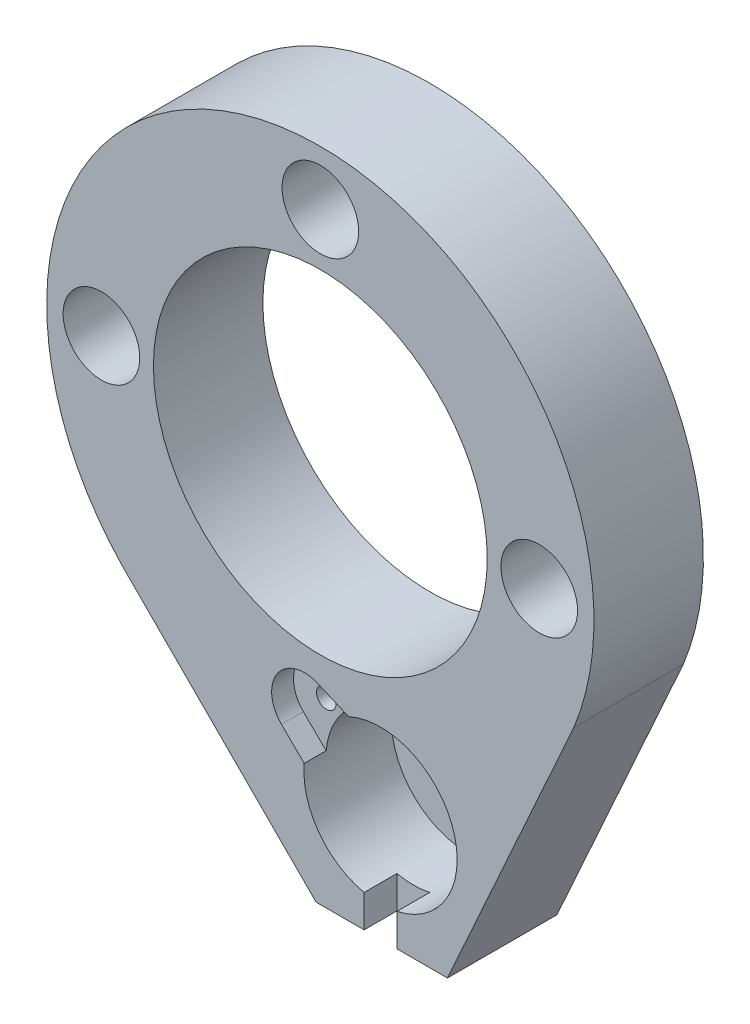
ISO-10303-21;
HEADER;
FILE_DESCRIPTION(('STEP AP214'),'2;1');
FILE_NAME('part.step','',(''),(''),'','','');
FILE_SCHEMA(('AUTOMOTIVE_DESIGN { 1 0 10303 214 1 1 1 1 }'));
ENDSEC;
DATA;
#1=APPLICATION_CONTEXT('core data for automotive mechanical design processes');
#2=APPLICATION_PROTOCOL_DEFINITION('international standard','automotive_design',2000,#1);
#3=PRODUCT_CONTEXT('',#1,'mechanical');
#4=PRODUCT('Part','Part','',(#3));
#5=PRODUCT_RELATED_PRODUCT_CATEGORY('part','',(#4));
#6=PRODUCT_DEFINITION_FORMATION('','',#4);
#7=PRODUCT_DEFINITION_CONTEXT('part definition',#1,'design');
#8=PRODUCT_DEFINITION('design','',#6,#7);
#9=PRODUCT_DEFINITION_SHAPE('','',#8);
#10=(LENGTH_UNIT() NAMED_UNIT(*) SI_UNIT(.MILLI.,.METRE.));
#11=(NAMED_UNIT(*) PLANE_ANGLE_UNIT() SI_UNIT($,.RADIAN.));
#12=(NAMED_UNIT(*) SI_UNIT($,.STERADIAN.) SOLID_ANGLE_UNIT());
#13=UNCERTAINTY_MEASURE_WITH_UNIT(LENGTH_MEASURE(1.E-05),#10,'distance_accuracy_value','');
#14=(GEOMETRIC_REPRESENTATION_CONTEXT(3) GLOBAL_UNCERTAINTY_ASSIGNED_CONTEXT((#13)) GLOBAL_UNIT_ASSIGNED_CONTEXT((#10,
#11,#12)) REPRESENTATION_CONTEXT('',''));
#15=CARTESIAN_POINT('',(0.,0.,0.));
#16=DIRECTION('',(0.,0.,1.));
#17=DIRECTION('',(1.,0.,0.));
#18=AXIS2_PLACEMENT_3D('',#15,#16,#17);
#19=CARTESIAN_POINT('',(20.,0.,10.));
#20=DIRECTION('',(0.,0.,-1.));
#21=DIRECTION('',(-1.,0.,0.));
#22=AXIS2_PLACEMENT_3D('',#19,#20,#21);
#23=CYLINDRICAL_SURFACE('',#22,1.5);
#24=CARTESIAN_POINT('',(20.,0.,0.));
#25=DIRECTION('',(0.,0.,1.));
#26=DIRECTION('',(1.,0.,0.));
#27=AXIS2_PLACEMENT_3D('',#24,#25,#26);
#28=CIRCLE('',#27,1.5);
#29=CARTESIAN_POINT('',(21.5,0.,0.));
#30=VERTEX_POINT('',#29);
#31=EDGE_CURVE('E293',#30,#30,#28,.T.);
#32=ORIENTED_EDGE('',*,*,#31,.F.);
#33=EDGE_LOOP('',(#32));
#34=FACE_BOUND('',#33,.T.);
#35=CARTESIAN_POINT('',(20.,0.,5.));
#36=DIRECTION('',(0.,0.,1.));
#37=DIRECTION('',(1.,0.,0.));
#38=AXIS2_PLACEMENT_3D('',#35,#36,#37);
#39=CIRCLE('',#38,1.5);
#40=CARTESIAN_POINT('',(21.5,0.,5.));
#41=VERTEX_POINT('',#40);
#42=EDGE_CURVE('E34',#41,#41,#39,.T.);
#43=ORIENTED_EDGE('',*,*,#42,.T.);
#44=EDGE_LOOP('',(#43));
#45=FACE_BOUND('',#44,.T.);
#46=ADVANCED_FACE('F30',(#34,#45),#23,.F.);
#47=CARTESIAN_POINT('',(0.,20.,10.));
#48=DIRECTION('',(0.,0.,-1.));
#49=DIRECTION('',(-1.,0.,0.));
#50=AXIS2_PLACEMENT_3D('',#47,#48,#49);
#51=CYLINDRICAL_SURFACE('',#50,1.5);
#52=CARTESIAN_POINT('',(0.,20.,0.));
#53=DIRECTION('',(0.,0.,1.));
#54=DIRECTION('',(1.,0.,0.));
#55=AXIS2_PLACEMENT_3D('',#52,#53,#54);
#56=CIRCLE('',#55,1.5);
#57=CARTESIAN_POINT('',(1.5,20.,0.));
#58=VERTEX_POINT('',#57);
#59=EDGE_CURVE('E169',#58,#58,#56,.T.);
#60=ORIENTED_EDGE('',*,*,#59,.F.);
#61=EDGE_LOOP('',(#60));
#62=FACE_BOUND('',#61,.T.);
#63=CARTESIAN_POINT('',(0.,20.,5.));
#64=DIRECTION('',(0.,0.,1.));
#65=DIRECTION('',(1.,0.,0.));
#66=AXIS2_PLACEMENT_3D('',#63,#64,#65);
#67=CIRCLE('',#66,1.5);
#68=CARTESIAN_POINT('',(1.5,20.,5.));
#69=VERTEX_POINT('',#68);
#70=EDGE_CURVE('E295',#69,#69,#67,.T.);
#71=ORIENTED_EDGE('',*,*,#70,.T.);
#72=EDGE_LOOP('',(#71));
#73=FACE_BOUND('',#72,.T.);
#74=ADVANCED_FACE('F327',(#62,#73),#51,.F.);
#75=CARTESIAN_POINT('',(-20.,0.,10.));
#76=DIRECTION('',(0.,0.,-1.));
#77=DIRECTION('',(-1.,0.,0.));
#78=AXIS2_PLACEMENT_3D('',#75,#76,#77);
#79=CYLINDRICAL_SURFACE('',#78,1.5);
#80=CARTESIAN_POINT('',(-20.,0.,0.));
#81=DIRECTION('',(0.,0.,1.));
#82=DIRECTION('',(1.,0.,0.));
#83=AXIS2_PLACEMENT_3D('',#80,#81,#82);
#84=CIRCLE('',#83,1.5);
#85=CARTESIAN_POINT('',(-18.5,0.,0.));
#86=VERTEX_POINT('',#85);
#87=EDGE_CURVE('E317',#86,#86,#84,.T.);
#88=ORIENTED_EDGE('',*,*,#87,.F.);
#89=EDGE_LOOP('',(#88));
#90=FACE_BOUND('',#89,.T.);
#91=CARTESIAN_POINT('',(-20.,0.,5.));
#92=DIRECTION('',(0.,0.,1.));
#93=DIRECTION('',(1.,0.,0.));
#94=AXIS2_PLACEMENT_3D('',#91,#92,#93);
#95=CIRCLE('',#94,1.5);
#96=CARTESIAN_POINT('',(-18.5,0.,5.));
#97=VERTEX_POINT('',#96);
#98=EDGE_CURVE('E291',#97,#97,#95,.T.);
#99=ORIENTED_EDGE('',*,*,#98,.T.);
#100=EDGE_LOOP('',(#99));
#101=FACE_BOUND('',#100,.T.);
#102=ADVANCED_FACE('F329',(#90,#101),#79,.F.);
#103=CARTESIAN_POINT('',(0.,0.,10.));
#104=DIRECTION('',(0.,0.,1.));
#105=DIRECTION('',(1.,0.,0.));
#106=AXIS2_PLACEMENT_3D('',#103,#104,#105);
#107=PLANE('',#106);
#108=CARTESIAN_POINT('',(20.,0.,10.));
#109=DIRECTION('',(0.,0.,1.));
#110=DIRECTION('',(1.,0.,0.));
#111=AXIS2_PLACEMENT_3D('',#108,#109,#110);
#112=CIRCLE('',#111,3.5);
#113=CARTESIAN_POINT('',(23.5,0.,10.));
#114=VERTEX_POINT('',#113);
#115=EDGE_CURVE('E311',#114,#114,#112,.T.);
#116=ORIENTED_EDGE('',*,*,#115,.F.);
#117=EDGE_LOOP('',(#116));
#118=FACE_BOUND('',#117,.T.);
#119=CARTESIAN_POINT('',(0.,20.,10.));
#120=DIRECTION('',(0.,0.,1.));
#121=DIRECTION('',(1.,0.,0.));
#122=AXIS2_PLACEMENT_3D('',#119,#120,#121);
#123=CIRCLE('',#122,3.5);
#124=CARTESIAN_POINT('',(3.5,20.,10.));
#125=VERTEX_POINT('',#124);
#126=EDGE_CURVE('E304',#125,#125,#123,.T.);
#127=ORIENTED_EDGE('',*,*,#126,.F.);
#128=EDGE_LOOP('',(#127));
#129=FACE_BOUND('',#128,.T.);
#130=CARTESIAN_POINT('',(-20.,0.,10.));
#131=DIRECTION('',(0.,0.,1.));
#132=DIRECTION('',(1.,0.,0.));
#133=AXIS2_PLACEMENT_3D('',#130,#131,#132);
#134=CIRCLE('',#133,3.5);
#135=CARTESIAN_POINT('',(-16.5,0.,10.));
#136=VERTEX_POINT('',#135);
#137=EDGE_CURVE('E297',#136,#136,#134,.T.);
#138=ORIENTED_EDGE('',*,*,#137,.F.);
#139=EDGE_LOOP('',(#138));
#140=FACE_BOUND('',#139,.T.);
#141=CARTESIAN_POINT('',(0.,0.,10.));
#142=DIRECTION('',(0.,0.,1.));
#143=DIRECTION('',(1.,0.,0.));
#144=AXIS2_PLACEMENT_3D('',#141,#142,#143);
#145=CIRCLE('',#144,15.25);
#146=CARTESIAN_POINT('',(15.25,0.,10.));
#147=VERTEX_POINT('',#146);
#148=EDGE_CURVE('E251',#147,#147,#145,.T.);
#149=ORIENTED_EDGE('',*,*,#148,.F.);
#150=EDGE_LOOP('',(#149));
#151=FACE_BOUND('',#150,.T.);
#152=DIRECTION('',(-0.919751155742739,0.392501989179541,0.));
#153=VECTOR('',#152,1.);
#154=CARTESIAN_POINT('',(-0.272375102761685,-17.6115350120765,10.));
#155=LINE('',#154,#153);
#156=CARTESIAN_POINT('',(2.59054903818514,-18.8332822348721,10.));
#157=VERTEX_POINT('',#156);
#158=CARTESIAN_POINT('',(-0.272375102761685,-17.6115350120765,10.));
#159=VERTEX_POINT('',#158);
#160=EDGE_CURVE('E163',#157,#159,#155,.T.);
#161=ORIENTED_EDGE('',*,*,#160,.F.);
#162=CARTESIAN_POINT('',(5.5,-25.2,10.));
#163=DIRECTION('',(0.,0.,1.));
#164=DIRECTION('',(1.,0.,0.));
#165=AXIS2_PLACEMENT_3D('',#162,#163,#164);
#166=CIRCLE('',#165,7.);
#167=CARTESIAN_POINT('',(7.,-32.0373971655887,10.));
#168=VERTEX_POINT('',#167);
#169=EDGE_CURVE('E244',#168,#157,#166,.T.);
#170=ORIENTED_EDGE('',*,*,#169,.F.);
#171=DIRECTION('',(0.,1.,0.));
#172=VECTOR('',#171,1.);
#173=CARTESIAN_POINT('',(7.,-35.,10.));
#174=LINE('',#173,#172);
#175=CARTESIAN_POINT('',(7.,-35.,10.));
#176=VERTEX_POINT('',#175);
#177=EDGE_CURVE('E221',#176,#168,#174,.T.);
#178=ORIENTED_EDGE('',*,*,#177,.F.);
#179=DIRECTION('',(1.,0.,0.));
#180=VECTOR('',#179,1.);
#181=CARTESIAN_POINT('',(-0.385076954837017,-35.,10.));
#182=LINE('',#181,#180);
#183=CARTESIAN_POINT('',(11.614923045163,-35.,10.));
#184=VERTEX_POINT('',#183);
#185=EDGE_CURVE('E258',#176,#184,#182,.T.);
#186=ORIENTED_EDGE('',*,*,#185,.T.);
#187=DIRECTION('',(0.411264502619458,0.911516049713426,0.));
#188=VECTOR('',#187,1.);
#189=CARTESIAN_POINT('',(11.614923045163,-35.,10.));
#190=LINE('',#189,#188);
#191=CARTESIAN_POINT('',(23.1670303134359,-9.3962070249831,10.));
#192=VERTEX_POINT('',#191);
#193=EDGE_CURVE('E263',#184,#192,#190,.T.);
#194=ORIENTED_EDGE('',*,*,#193,.T.);
#195=CARTESIAN_POINT('',(0.,0.,10.));
#196=DIRECTION('',(0.,0.,1.));
#197=DIRECTION('',(1.,0.,0.));
#198=AXIS2_PLACEMENT_3D('',#195,#196,#197);
#199=CIRCLE('',#198,25.);
#200=CARTESIAN_POINT('',(-18.121718507486,-17.2221751917532,10.));
#201=VERTEX_POINT('',#200);
#202=EDGE_CURVE('E265',#192,#201,#199,.T.);
#203=ORIENTED_EDGE('',*,*,#202,.T.);
#204=DIRECTION('',(0.706286331738627,-0.707926279777206,0.));
#205=VECTOR('',#204,1.);
#206=CARTESIAN_POINT('',(-18.121718507486,-17.2221751917532,10.));
#207=LINE('',#206,#205);
#208=CARTESIAN_POINT('',(-0.385076954837017,-35.,10.));
#209=VERTEX_POINT('',#208);
#210=EDGE_CURVE('E255',#201,#209,#207,.T.);
#211=ORIENTED_EDGE('',*,*,#210,.T.);
#212=CARTESIAN_POINT('',(4.,-35.,10.));
#213=VERTEX_POINT('',#212);
#214=EDGE_CURVE('E260',#209,#213,#182,.T.);
#215=ORIENTED_EDGE('',*,*,#214,.T.);
#216=DIRECTION('',(0.,-1.,0.));
#217=VECTOR('',#216,1.);
#218=CARTESIAN_POINT('',(4.,-35.,10.));
#219=LINE('',#218,#217);
#220=CARTESIAN_POINT('',(4.,-32.0373971655887,10.));
#221=VERTEX_POINT('',#220);
#222=EDGE_CURVE('E210',#221,#213,#219,.T.);
#223=ORIENTED_EDGE('',*,*,#222,.F.);
#224=CARTESIAN_POINT('',(-1.47056063690864,-24.5586854070115,10.));
#225=VERTEX_POINT('',#224);
#226=EDGE_CURVE('E232',#225,#221,#166,.T.);
#227=ORIENTED_EDGE('',*,*,#226,.F.);
#228=DIRECTION('',(0.712887138889984,-0.701278779947927,0.));
#229=VECTOR('',#228,1.);
#230=CARTESIAN_POINT('',(-3.55371741014409,-22.5094498959747,10.));
#231=LINE('',#230,#229);
#232=CARTESIAN_POINT('',(-3.55371741014409,-22.5094498959747,10.));
#233=VERTEX_POINT('',#232);
#234=EDGE_CURVE('E166',#233,#225,#231,.T.);
#235=ORIENTED_EDGE('',*,*,#234,.F.);
#236=CARTESIAN_POINT('',(-1.44988107030031,-20.3707884793047,10.));
#237=DIRECTION('',(0.,0.,1.));
#238=DIRECTION('',(1.,0.,0.));
#239=AXIS2_PLACEMENT_3D('',#236,#237,#238);
#240=CIRCLE('',#239,3.);
#241=EDGE_CURVE('E151',#159,#233,#240,.T.);
#242=ORIENTED_EDGE('',*,*,#241,.F.);
#243=EDGE_LOOP('',(#161,#170,#178,#186,#194,#203,#211,#215,#223,#227,#235,#242));
#244=FACE_BOUND('',#243,.T.);
#245=ADVANCED_FACE('F335',(#118,#129,#140,#151,#244),#107,.T.);
#246=CARTESIAN_POINT('',(0.,0.,0.));
#247=DIRECTION('',(0.,0.,1.));
#248=DIRECTION('',(1.,0.,0.));
#249=AXIS2_PLACEMENT_3D('',#246,#247,#248);
#250=PLANE('',#249);
#251=ORIENTED_EDGE('',*,*,#87,.T.);
#252=EDGE_LOOP('',(#251));
#253=FACE_BOUND('',#252,.T.);
#254=DIRECTION('',(0.706286331738627,-0.707926279777206,0.));
#255=VECTOR('',#254,1.);
#256=CARTESIAN_POINT('',(-18.121718507486,-17.2221751917532,0.));
#257=LINE('',#256,#255);
#258=CARTESIAN_POINT('',(-18.121718507486,-17.2221751917532,0.));
#259=VERTEX_POINT('',#258);
#260=CARTESIAN_POINT('',(-0.385076954837017,-35.,0.));
#261=VERTEX_POINT('',#260);
#262=EDGE_CURVE('E250',#259,#261,#257,.T.);
#263=ORIENTED_EDGE('',*,*,#262,.F.);
#264=CARTESIAN_POINT('',(0.,0.,0.));
#265=DIRECTION('',(0.,0.,1.));
#266=DIRECTION('',(1.,0.,0.));
#267=AXIS2_PLACEMENT_3D('',#264,#265,#266);
#268=CIRCLE('',#267,25.);
#269=CARTESIAN_POINT('',(23.1670303134359,-9.3962070249831,0.));
#270=VERTEX_POINT('',#269);
#271=EDGE_CURVE('E259',#270,#259,#268,.T.);
#272=ORIENTED_EDGE('',*,*,#271,.F.);
#273=DIRECTION('',(0.411264502619458,0.911516049713426,0.));
#274=VECTOR('',#273,1.);
#275=CARTESIAN_POINT('',(11.614923045163,-35.,0.));
#276=LINE('',#275,#274);
#277=CARTESIAN_POINT('',(11.614923045163,-35.,0.));
#278=VERTEX_POINT('',#277);
#279=EDGE_CURVE('E272',#278,#270,#276,.T.);
#280=ORIENTED_EDGE('',*,*,#279,.F.);
#281=DIRECTION('',(1.,0.,0.));
#282=VECTOR('',#281,1.);
#283=CARTESIAN_POINT('',(-0.385076954837017,-35.,0.));
#284=LINE('',#283,#282);
#285=EDGE_CURVE('E270',#261,#278,#284,.T.);
#286=ORIENTED_EDGE('',*,*,#285,.F.);
#287=EDGE_LOOP('',(#263,#272,#280,#286));
#288=FACE_BOUND('',#287,.T.);
#289=CARTESIAN_POINT('',(0.,0.,0.));
#290=DIRECTION('',(0.,0.,1.));
#291=DIRECTION('',(1.,0.,0.));
#292=AXIS2_PLACEMENT_3D('',#289,#290,#291);
#293=CIRCLE('',#292,15.25);
#294=CARTESIAN_POINT('',(15.25,0.,0.));
#295=VERTEX_POINT('',#294);
#296=EDGE_CURVE('E247',#295,#295,#293,.T.);
#297=ORIENTED_EDGE('',*,*,#296,.T.);
#298=EDGE_LOOP('',(#297));
#299=FACE_BOUND('',#298,.T.);
#300=CARTESIAN_POINT('',(5.5,-25.2,0.));
#301=DIRECTION('',(0.,0.,1.));
#302=DIRECTION('',(1.,0.,0.));
#303=AXIS2_PLACEMENT_3D('',#300,#301,#302);
#304=CIRCLE('',#303,2.65);
#305=CARTESIAN_POINT('',(8.15,-25.2,0.));
#306=VERTEX_POINT('',#305);
#307=EDGE_CURVE('E254',#306,#306,#304,.T.);
#308=ORIENTED_EDGE('',*,*,#307,.T.);
#309=EDGE_LOOP('',(#308));
#310=FACE_BOUND('',#309,.T.);
#311=DIRECTION('',(1.,0.,0.));
#312=VECTOR('',#311,1.);
#313=CARTESIAN_POINT('',(0.5,-25.7910088137421,0.));
#314=LINE('',#313,#312);
#315=CARTESIAN_POINT('',(-0.5,-25.7910088137421,0.));
#316=VERTEX_POINT('',#315);
#317=CARTESIAN_POINT('',(0.5,-25.7910088137421,0.));
#318=VERTEX_POINT('',#317);
#319=EDGE_CURVE('E195',#316,#318,#314,.T.);
#320=ORIENTED_EDGE('',*,*,#319,.T.);
#321=DIRECTION('',(0.,1.,0.));
#322=VECTOR('',#321,1.);
#323=CARTESIAN_POINT('',(0.499999999999999,-23.6910088137421,0.));
#324=LINE('',#323,#322);
#325=CARTESIAN_POINT('',(0.499999999999999,-23.6910088137421,0.));
#326=VERTEX_POINT('',#325);
#327=EDGE_CURVE('E187',#318,#326,#324,.T.);
#328=ORIENTED_EDGE('',*,*,#327,.T.);
#329=DIRECTION('',(-1.,0.,0.));
#330=VECTOR('',#329,1.);
#331=CARTESIAN_POINT('',(0.499999999999999,-23.6910088137421,0.));
#332=LINE('',#331,#330);
#333=CARTESIAN_POINT('',(-0.500000000000001,-23.6910088137421,0.));
#334=VERTEX_POINT('',#333);
#335=EDGE_CURVE('E190',#326,#334,#332,.T.);
#336=ORIENTED_EDGE('',*,*,#335,.T.);
#337=DIRECTION('',(0.,-1.,0.));
#338=VECTOR('',#337,1.);
#339=CARTESIAN_POINT('',(-0.500000000000001,-23.6910088137421,0.));
#340=LINE('',#339,#338);
#341=EDGE_CURVE('E55',#334,#316,#340,.T.);
#342=ORIENTED_EDGE('',*,*,#341,.T.);
#343=EDGE_LOOP('',(#320,#328,#336,#342));
#344=FACE_BOUND('',#343,.T.);
#345=ORIENTED_EDGE('',*,*,#59,.T.);
#346=EDGE_LOOP('',(#345));
#347=FACE_BOUND('',#346,.T.);
#348=ORIENTED_EDGE('',*,*,#31,.T.);
#349=EDGE_LOOP('',(#348));
#350=FACE_BOUND('',#349,.T.);
#351=ADVANCED_FACE('F324',(#253,#288,#299,#310,#344,#347,#350),#250,.F.);
#352=CARTESIAN_POINT('',(5.5,-25.2,10.));
#353=DIRECTION('',(0.,0.,1.));
#354=DIRECTION('',(1.,0.,0.));
#355=AXIS2_PLACEMENT_3D('',#352,#353,#354);
#356=CYLINDRICAL_SURFACE('',#355,2.65);
#357=ORIENTED_EDGE('',*,*,#307,.F.);
#358=EDGE_LOOP('',(#357));
#359=FACE_BOUND('',#358,.T.);
#360=CARTESIAN_POINT('',(5.5,-25.2,2.));
#361=DIRECTION('',(0.,0.,1.));
#362=DIRECTION('',(1.,0.,0.));
#363=AXIS2_PLACEMENT_3D('',#360,#361,#362);
#364=CIRCLE('',#363,2.65);
#365=CARTESIAN_POINT('',(8.15,-25.2,2.));
#366=VERTEX_POINT('',#365);
#367=EDGE_CURVE('E243',#366,#366,#364,.F.);
#368=ORIENTED_EDGE('',*,*,#367,.F.);
#369=EDGE_LOOP('',(#368));
#370=FACE_BOUND('',#369,.T.);
#371=ADVANCED_FACE('F397',(#359,#370),#356,.F.);
#372=CARTESIAN_POINT('',(-18.121718507486,-17.2221751917532,10.));
#373=DIRECTION('',(0.707926279777206,0.706286331738627,0.));
#374=DIRECTION('',(-0.706286331738627,0.707926279777206,0.));
#375=AXIS2_PLACEMENT_3D('',#372,#373,#374);
#376=PLANE('',#375);
#377=ORIENTED_EDGE('',*,*,#262,.T.);
#378=DIRECTION('',(0.,0.,-1.));
#379=VECTOR('',#378,1.);
#380=CARTESIAN_POINT('',(-0.385076954837017,-35.,10.));
#381=LINE('',#380,#379);
#382=EDGE_CURVE('E39',#209,#261,#381,.T.);
#383=ORIENTED_EDGE('',*,*,#382,.F.);
#384=ORIENTED_EDGE('',*,*,#210,.F.);
#385=DIRECTION('',(0.,0.,-1.));
#386=VECTOR('',#385,1.);
#387=CARTESIAN_POINT('',(-18.121718507486,-17.2221751917532,10.));
#388=LINE('',#387,#386);
#389=EDGE_CURVE('E267',#201,#259,#388,.T.);
#390=ORIENTED_EDGE('',*,*,#389,.T.);
#391=EDGE_LOOP('',(#377,#383,#384,#390));
#392=FACE_BOUND('',#391,.T.);
#393=ADVANCED_FACE('F32',(#392),#376,.F.);
#394=CARTESIAN_POINT('',(-0.385076954837017,-35.,10.));
#395=DIRECTION('',(0.,1.,0.));
#396=DIRECTION('',(0.,0.,1.));
#397=AXIS2_PLACEMENT_3D('',#394,#395,#396);
#398=PLANE('',#397);
#399=DIRECTION('',(1.,0.,0.));
#400=VECTOR('',#399,1.);
#401=CARTESIAN_POINT('',(4.,-35.,7.));
#402=LINE('',#401,#400);
#403=CARTESIAN_POINT('',(4.,-35.,7.));
#404=VERTEX_POINT('',#403);
#405=CARTESIAN_POINT('',(7.,-35.,7.));
#406=VERTEX_POINT('',#405);
#407=EDGE_CURVE('E220',#404,#406,#402,.T.);
#408=ORIENTED_EDGE('',*,*,#407,.F.);
#409=DIRECTION('',(0.,0.,1.));
#410=VECTOR('',#409,1.);
#411=CARTESIAN_POINT('',(4.,-35.,7.));
#412=LINE('',#411,#410);
#413=EDGE_CURVE('E226',#404,#213,#412,.T.);
#414=ORIENTED_EDGE('',*,*,#413,.T.);
#415=ORIENTED_EDGE('',*,*,#214,.F.);
#416=ORIENTED_EDGE('',*,*,#382,.T.);
#417=ORIENTED_EDGE('',*,*,#285,.T.);
#418=DIRECTION('',(0.,0.,-1.));
#419=VECTOR('',#418,1.);
#420=CARTESIAN_POINT('',(11.614923045163,-35.,10.));
#421=LINE('',#420,#419);
#422=EDGE_CURVE('E280',#184,#278,#421,.T.);
#423=ORIENTED_EDGE('',*,*,#422,.F.);
#424=ORIENTED_EDGE('',*,*,#185,.F.);
#425=DIRECTION('',(0.,0.,1.));
#426=VECTOR('',#425,1.);
#427=CARTESIAN_POINT('',(7.,-35.,7.));
#428=LINE('',#427,#426);
#429=EDGE_CURVE('E236',#406,#176,#428,.T.);
#430=ORIENTED_EDGE('',*,*,#429,.F.);
#431=EDGE_LOOP('',(#408,#414,#415,#416,#417,#423,#424,#430));
#432=FACE_BOUND('',#431,.T.);
#433=ADVANCED_FACE('F415',(#432),#398,.F.);
#434=CARTESIAN_POINT('',(11.614923045163,-35.,10.));
#435=DIRECTION('',(-0.911516049713426,0.411264502619458,0.));
#436=DIRECTION('',(-0.411264502619458,-0.911516049713427,0.));
#437=AXIS2_PLACEMENT_3D('',#434,#435,#436);
#438=PLANE('',#437);
#439=ORIENTED_EDGE('',*,*,#279,.T.);
#440=DIRECTION('',(0.,0.,-1.));
#441=VECTOR('',#440,1.);
#442=CARTESIAN_POINT('',(23.1670303134359,-9.3962070249831,10.));
#443=LINE('',#442,#441);
#444=EDGE_CURVE('E277',#192,#270,#443,.T.);
#445=ORIENTED_EDGE('',*,*,#444,.F.);
#446=ORIENTED_EDGE('',*,*,#193,.F.);
#447=ORIENTED_EDGE('',*,*,#422,.T.);
#448=EDGE_LOOP('',(#439,#445,#446,#447));
#449=FACE_BOUND('',#448,.T.);
#450=ADVANCED_FACE('F412',(#449),#438,.F.);
#451=CARTESIAN_POINT('',(0.,0.,10.));
#452=DIRECTION('',(0.,0.,-1.));
#453=DIRECTION('',(-1.,0.,0.));
#454=AXIS2_PLACEMENT_3D('',#451,#452,#453);
#455=CYLINDRICAL_SURFACE('',#454,25.);
#456=ORIENTED_EDGE('',*,*,#271,.T.);
#457=ORIENTED_EDGE('',*,*,#389,.F.);
#458=ORIENTED_EDGE('',*,*,#202,.F.);
#459=ORIENTED_EDGE('',*,*,#444,.T.);
#460=EDGE_LOOP('',(#456,#457,#458,#459));
#461=FACE_BOUND('',#460,.T.);
#462=ADVANCED_FACE('F403',(#461),#455,.T.);
#463=CARTESIAN_POINT('',(0.,0.,0.));
#464=DIRECTION('',(0.,0.,1.));
#465=DIRECTION('',(1.,0.,0.));
#466=AXIS2_PLACEMENT_3D('',#463,#464,#465);
#467=CYLINDRICAL_SURFACE('',#466,15.25);
#468=ORIENTED_EDGE('',*,*,#296,.F.);
#469=EDGE_LOOP('',(#468));
#470=FACE_BOUND('',#469,.T.);
#471=ORIENTED_EDGE('',*,*,#148,.T.);
#472=EDGE_LOOP('',(#471));
#473=FACE_BOUND('',#472,.T.);
#474=ADVANCED_FACE('F392',(#470,#473),#467,.F.);
#475=CARTESIAN_POINT('',(5.5,-25.2,2.));
#476=DIRECTION('',(0.,0.,1.));
#477=DIRECTION('',(1.,0.,0.));
#478=AXIS2_PLACEMENT_3D('',#475,#476,#477);
#479=PLANE('',#478);
#480=DIRECTION('',(0.,1.,0.));
#481=VECTOR('',#480,1.);
#482=CARTESIAN_POINT('',(0.499999999999999,-23.6910088137421,2.));
#483=LINE('',#482,#481);
#484=CARTESIAN_POINT('',(0.5,-25.7910088137421,2.));
#485=VERTEX_POINT('',#484);
#486=CARTESIAN_POINT('',(0.5,-23.6910088137421,2.));
#487=VERTEX_POINT('',#486);
#488=EDGE_CURVE('E186',#485,#487,#483,.T.);
#489=ORIENTED_EDGE('',*,*,#488,.F.);
#490=DIRECTION('',(1.,0.,0.));
#491=VECTOR('',#490,1.);
#492=CARTESIAN_POINT('',(0.5,-25.7910088137421,2.));
#493=LINE('',#492,#491);
#494=CARTESIAN_POINT('',(-0.5,-25.7910088137421,2.));
#495=VERTEX_POINT('',#494);
#496=EDGE_CURVE('E191',#495,#485,#493,.T.);
#497=ORIENTED_EDGE('',*,*,#496,.F.);
#498=DIRECTION('',(0.,-1.,0.));
#499=VECTOR('',#498,1.);
#500=CARTESIAN_POINT('',(-0.500000000000001,-23.6910088137421,2.));
#501=LINE('',#500,#499);
#502=CARTESIAN_POINT('',(-0.500000000000001,-23.6910088137421,2.));
#503=VERTEX_POINT('',#502);
#504=EDGE_CURVE('E203',#503,#495,#501,.T.);
#505=ORIENTED_EDGE('',*,*,#504,.F.);
#506=DIRECTION('',(-1.,0.,0.));
#507=VECTOR('',#506,1.);
#508=CARTESIAN_POINT('',(0.499999999999999,-23.6910088137421,2.));
#509=LINE('',#508,#507);
#510=EDGE_CURVE('E200',#487,#503,#509,.T.);
#511=ORIENTED_EDGE('',*,*,#510,.F.);
#512=EDGE_LOOP('',(#489,#497,#505,#511));
#513=FACE_BOUND('',#512,.T.);
#514=CARTESIAN_POINT('',(5.5,-25.2,2.));
#515=DIRECTION('',(0.,0.,1.));
#516=DIRECTION('',(1.,0.,0.));
#517=AXIS2_PLACEMENT_3D('',#514,#515,#516);
#518=CIRCLE('',#517,7.);
#519=CARTESIAN_POINT('',(12.5,-25.2,2.));
#520=VERTEX_POINT('',#519);
#521=EDGE_CURVE('E240',#520,#520,#518,.T.);
#522=ORIENTED_EDGE('',*,*,#521,.T.);
#523=EDGE_LOOP('',(#522));
#524=FACE_BOUND('',#523,.T.);
#525=ORIENTED_EDGE('',*,*,#367,.T.);
#526=EDGE_LOOP('',(#525));
#527=FACE_BOUND('',#526,.T.);
#528=ADVANCED_FACE('F389',(#513,#524,#527),#479,.T.);
#529=CARTESIAN_POINT('',(5.5,-25.2,2.));
#530=DIRECTION('',(0.,0.,1.));
#531=DIRECTION('',(1.,0.,0.));
#532=AXIS2_PLACEMENT_3D('',#529,#530,#531);
#533=CYLINDRICAL_SURFACE('',#532,7.);
#534=ORIENTED_EDGE('',*,*,#169,.T.);
#535=DIRECTION('',(0.,0.,1.));
#536=VECTOR('',#535,1.);
#537=CARTESIAN_POINT('',(2.59054903818514,-18.8332822348721,8.));
#538=LINE('',#537,#536);
#539=CARTESIAN_POINT('',(2.59054903818514,-18.8332822348721,8.));
#540=VERTEX_POINT('',#539);
#541=EDGE_CURVE('E178',#540,#157,#538,.T.);
#542=ORIENTED_EDGE('',*,*,#541,.F.);
#543=CARTESIAN_POINT('',(5.5,-25.2,8.));
#544=DIRECTION('',(0.,0.,1.));
#545=DIRECTION('',(1.,0.,0.));
#546=AXIS2_PLACEMENT_3D('',#543,#544,#545);
#547=CIRCLE('',#546,7.);
#548=CARTESIAN_POINT('',(-1.47056063690863,-24.5586854070115,8.));
#549=VERTEX_POINT('',#548);
#550=EDGE_CURVE('E181',#549,#540,#547,.F.);
#551=ORIENTED_EDGE('',*,*,#550,.F.);
#552=DIRECTION('',(0.,0.,1.));
#553=VECTOR('',#552,1.);
#554=CARTESIAN_POINT('',(-1.47056063690864,-24.5586854070115,8.));
#555=LINE('',#554,#553);
#556=EDGE_CURVE('E154',#549,#225,#555,.T.);
#557=ORIENTED_EDGE('',*,*,#556,.T.);
#558=ORIENTED_EDGE('',*,*,#226,.T.);
#559=DIRECTION('',(0.,0.,1.));
#560=VECTOR('',#559,1.);
#561=CARTESIAN_POINT('',(4.,-32.0373971655887,7.));
#562=LINE('',#561,#560);
#563=CARTESIAN_POINT('',(4.,-32.0373971655887,7.));
#564=VERTEX_POINT('',#563);
#565=EDGE_CURVE('E229',#564,#221,#562,.T.);
#566=ORIENTED_EDGE('',*,*,#565,.F.);
#567=CARTESIAN_POINT('',(5.5,-25.2,7.));
#568=DIRECTION('',(0.,0.,-1.));
#569=DIRECTION('',(-1.,0.,0.));
#570=AXIS2_PLACEMENT_3D('',#567,#568,#569);
#571=CIRCLE('',#570,7.);
#572=CARTESIAN_POINT('',(7.,-32.0373971655887,7.));
#573=VERTEX_POINT('',#572);
#574=EDGE_CURVE('E11',#564,#573,#571,.F.);
#575=ORIENTED_EDGE('',*,*,#574,.T.);
#576=DIRECTION('',(0.,0.,1.));
#577=VECTOR('',#576,1.);
#578=CARTESIAN_POINT('',(7.,-32.0373971655887,7.));
#579=LINE('',#578,#577);
#580=EDGE_CURVE('E233',#573,#168,#579,.T.);
#581=ORIENTED_EDGE('',*,*,#580,.T.);
#582=EDGE_LOOP('',(#534,#542,#551,#557,#558,#566,#575,#581));
#583=FACE_BOUND('',#582,.T.);
#584=ORIENTED_EDGE('',*,*,#521,.F.);
#585=EDGE_LOOP('',(#584));
#586=FACE_BOUND('',#585,.T.);
#587=ADVANCED_FACE('F381',(#583,#586),#533,.F.);
#588=CARTESIAN_POINT('',(4.,-32.0373971655887,7.));
#589=DIRECTION('',(0.,0.,-1.));
#590=DIRECTION('',(-1.,0.,0.));
#591=AXIS2_PLACEMENT_3D('',#588,#589,#590);
#592=PLANE('',#591);
#593=DIRECTION('',(0.,-1.,0.));
#594=VECTOR('',#593,1.);
#595=CARTESIAN_POINT('',(4.,-35.,7.));
#596=LINE('',#595,#594);
#597=EDGE_CURVE('E217',#564,#404,#596,.T.);
#598=ORIENTED_EDGE('',*,*,#597,.T.);
#599=ORIENTED_EDGE('',*,*,#407,.T.);
#600=DIRECTION('',(0.,1.,0.));
#601=VECTOR('',#600,1.);
#602=CARTESIAN_POINT('',(7.,-35.,7.));
#603=LINE('',#602,#601);
#604=EDGE_CURVE('E224',#406,#573,#603,.T.);
#605=ORIENTED_EDGE('',*,*,#604,.T.);
#606=ORIENTED_EDGE('',*,*,#574,.F.);
#607=EDGE_LOOP('',(#598,#599,#605,#606));
#608=FACE_BOUND('',#607,.T.);
#609=ADVANCED_FACE('F377',(#608),#592,.F.);
#610=CARTESIAN_POINT('',(4.,-35.,7.));
#611=DIRECTION('',(-1.,0.,0.));
#612=DIRECTION('',(0.,0.,1.));
#613=AXIS2_PLACEMENT_3D('',#610,#611,#612);
#614=PLANE('',#613);
#615=ORIENTED_EDGE('',*,*,#222,.T.);
#616=ORIENTED_EDGE('',*,*,#413,.F.);
#617=ORIENTED_EDGE('',*,*,#597,.F.);
#618=ORIENTED_EDGE('',*,*,#565,.T.);
#619=EDGE_LOOP('',(#615,#616,#617,#618));
#620=FACE_BOUND('',#619,.T.);
#621=ADVANCED_FACE('F380',(#620),#614,.F.);
#622=CARTESIAN_POINT('',(7.,-35.,7.));
#623=DIRECTION('',(1.,0.,0.));
#624=DIRECTION('',(0.,0.,-1.));
#625=AXIS2_PLACEMENT_3D('',#622,#623,#624);
#626=PLANE('',#625);
#627=ORIENTED_EDGE('',*,*,#177,.T.);
#628=ORIENTED_EDGE('',*,*,#580,.F.);
#629=ORIENTED_EDGE('',*,*,#604,.F.);
#630=ORIENTED_EDGE('',*,*,#429,.T.);
#631=EDGE_LOOP('',(#627,#628,#629,#630));
#632=FACE_BOUND('',#631,.T.);
#633=ADVANCED_FACE('F375',(#632),#626,.F.);
#634=CARTESIAN_POINT('',(0.499999999999999,-23.6910088137421,0.));
#635=DIRECTION('',(1.,0.,0.));
#636=DIRECTION('',(0.,1.,0.));
#637=AXIS2_PLACEMENT_3D('',#634,#635,#636);
#638=PLANE('',#637);
#639=ORIENTED_EDGE('',*,*,#488,.T.);
#640=DIRECTION('',(0.,0.,1.));
#641=VECTOR('',#640,1.);
#642=CARTESIAN_POINT('',(0.499999999999999,-23.6910088137421,0.));
#643=LINE('',#642,#641);
#644=EDGE_CURVE('E198',#326,#487,#643,.T.);
#645=ORIENTED_EDGE('',*,*,#644,.F.);
#646=ORIENTED_EDGE('',*,*,#327,.F.);
#647=DIRECTION('',(0.,0.,1.));
#648=VECTOR('',#647,1.);
#649=CARTESIAN_POINT('',(0.5,-25.7910088137421,0.));
#650=LINE('',#649,#648);
#651=EDGE_CURVE('E208',#318,#485,#650,.T.);
#652=ORIENTED_EDGE('',*,*,#651,.T.);
#653=EDGE_LOOP('',(#639,#645,#646,#652));
#654=FACE_BOUND('',#653,.T.);
#655=ADVANCED_FACE('F366',(#654),#638,.F.);
#656=CARTESIAN_POINT('',(0.5,-25.7910088137421,0.));
#657=DIRECTION('',(0.,-1.,0.));
#658=DIRECTION('',(0.,0.,-1.));
#659=AXIS2_PLACEMENT_3D('',#656,#657,#658);
#660=PLANE('',#659);
#661=ORIENTED_EDGE('',*,*,#496,.T.);
#662=ORIENTED_EDGE('',*,*,#651,.F.);
#663=ORIENTED_EDGE('',*,*,#319,.F.);
#664=DIRECTION('',(0.,0.,1.));
#665=VECTOR('',#664,1.);
#666=CARTESIAN_POINT('',(-0.5,-25.7910088137421,0.));
#667=LINE('',#666,#665);
#668=EDGE_CURVE('E211',#316,#495,#667,.T.);
#669=ORIENTED_EDGE('',*,*,#668,.T.);
#670=EDGE_LOOP('',(#661,#662,#663,#669));
#671=FACE_BOUND('',#670,.T.);
#672=ADVANCED_FACE('F362',(#671),#660,.F.);
#673=CARTESIAN_POINT('',(-0.500000000000001,-23.6910088137421,0.));
#674=DIRECTION('',(-1.,0.,0.));
#675=DIRECTION('',(0.,-1.,0.));
#676=AXIS2_PLACEMENT_3D('',#673,#674,#675);
#677=PLANE('',#676);
#678=ORIENTED_EDGE('',*,*,#504,.T.);
#679=ORIENTED_EDGE('',*,*,#668,.F.);
#680=ORIENTED_EDGE('',*,*,#341,.F.);
#681=DIRECTION('',(0.,0.,1.));
#682=VECTOR('',#681,1.);
#683=CARTESIAN_POINT('',(-0.500000000000001,-23.6910088137421,0.));
#684=LINE('',#683,#682);
#685=EDGE_CURVE('E213',#334,#503,#684,.T.);
#686=ORIENTED_EDGE('',*,*,#685,.T.);
#687=EDGE_LOOP('',(#678,#679,#680,#686));
#688=FACE_BOUND('',#687,.T.);
#689=ADVANCED_FACE('F365',(#688),#677,.F.);
#690=CARTESIAN_POINT('',(0.499999999999999,-23.6910088137421,0.));
#691=DIRECTION('',(0.,1.,0.));
#692=DIRECTION('',(0.,0.,1.));
#693=AXIS2_PLACEMENT_3D('',#690,#691,#692);
#694=PLANE('',#693);
#695=ORIENTED_EDGE('',*,*,#510,.T.);
#696=ORIENTED_EDGE('',*,*,#685,.F.);
#697=ORIENTED_EDGE('',*,*,#335,.F.);
#698=ORIENTED_EDGE('',*,*,#644,.T.);
#699=EDGE_LOOP('',(#695,#696,#697,#698));
#700=FACE_BOUND('',#699,.T.);
#701=ADVANCED_FACE('F343',(#700),#694,.F.);
#702=CARTESIAN_POINT('',(-1.44988107030031,-20.3707884793047,8.));
#703=DIRECTION('',(0.,0.,1.));
#704=DIRECTION('',(1.,0.,0.));
#705=AXIS2_PLACEMENT_3D('',#702,#703,#704);
#706=PLANE('',#705);
#707=CARTESIAN_POINT('',(-1.44988107030031,-20.3707884793047,8.));
#708=DIRECTION('',(0.,0.,1.));
#709=DIRECTION('',(1.,0.,0.));
#710=AXIS2_PLACEMENT_3D('',#707,#708,#709);
#711=CIRCLE('',#710,0.900000000000001);
#712=CARTESIAN_POINT('',(-0.549881070300307,-20.3707884793047,8.));
#713=VERTEX_POINT('',#712);
#714=EDGE_CURVE('E177',#713,#713,#711,.F.);
#715=ORIENTED_EDGE('',*,*,#714,.T.);
#716=EDGE_LOOP('',(#715));
#717=FACE_BOUND('',#716,.T.);
#718=ORIENTED_EDGE('',*,*,#550,.T.);
#719=DIRECTION('',(-0.919751155742739,0.392501989179541,0.));
#720=VECTOR('',#719,1.);
#721=CARTESIAN_POINT('',(-0.272375102761685,-17.6115350120765,8.));
#722=LINE('',#721,#720);
#723=CARTESIAN_POINT('',(-0.272375102761685,-17.6115350120765,8.));
#724=VERTEX_POINT('',#723);
#725=EDGE_CURVE('E155',#540,#724,#722,.T.);
#726=ORIENTED_EDGE('',*,*,#725,.T.);
#727=CARTESIAN_POINT('',(-1.44988107030031,-20.3707884793047,8.));
#728=DIRECTION('',(0.,0.,1.));
#729=DIRECTION('',(1.,0.,0.));
#730=AXIS2_PLACEMENT_3D('',#727,#728,#729);
#731=CIRCLE('',#730,3.);
#732=CARTESIAN_POINT('',(-3.55371741014409,-22.5094498959747,8.));
#733=VERTEX_POINT('',#732);
#734=EDGE_CURVE('E148',#724,#733,#731,.T.);
#735=ORIENTED_EDGE('',*,*,#734,.T.);
#736=DIRECTION('',(0.712887138889984,-0.701278779947927,0.));
#737=VECTOR('',#736,1.);
#738=CARTESIAN_POINT('',(-3.55371741014409,-22.5094498959747,8.));
#739=LINE('',#738,#737);
#740=EDGE_CURVE('E47',#733,#549,#739,.T.);
#741=ORIENTED_EDGE('',*,*,#740,.T.);
#742=EDGE_LOOP('',(#718,#726,#735,#741));
#743=FACE_BOUND('',#742,.T.);
#744=ADVANCED_FACE('F161',(#717,#743),#706,.T.);
#745=CARTESIAN_POINT('',(-1.44988107030031,-20.3707884793047,8.));
#746=DIRECTION('',(0.,0.,1.));
#747=DIRECTION('',(1.,0.,0.));
#748=AXIS2_PLACEMENT_3D('',#745,#746,#747);
#749=CYLINDRICAL_SURFACE('',#748,3.);
#750=ORIENTED_EDGE('',*,*,#241,.T.);
#751=DIRECTION('',(0.,0.,1.));
#752=VECTOR('',#751,1.);
#753=CARTESIAN_POINT('',(-3.55371741014409,-22.5094498959747,8.));
#754=LINE('',#753,#752);
#755=EDGE_CURVE('E146',#733,#233,#754,.T.);
#756=ORIENTED_EDGE('',*,*,#755,.F.);
#757=ORIENTED_EDGE('',*,*,#734,.F.);
#758=DIRECTION('',(0.,0.,1.));
#759=VECTOR('',#758,1.);
#760=CARTESIAN_POINT('',(-0.272375102761685,-17.6115350120765,8.));
#761=LINE('',#760,#759);
#762=EDGE_CURVE('E175',#724,#159,#761,.T.);
#763=ORIENTED_EDGE('',*,*,#762,.T.);
#764=EDGE_LOOP('',(#750,#756,#757,#763));
#765=FACE_BOUND('',#764,.T.);
#766=ADVANCED_FACE('F147',(#765),#749,.F.);
#767=CARTESIAN_POINT('',(-0.272375102761685,-17.6115350120765,8.));
#768=DIRECTION('',(0.392501989179541,0.919751155742739,0.));
#769=DIRECTION('',(-0.919751155742739,0.392501989179541,0.));
#770=AXIS2_PLACEMENT_3D('',#767,#768,#769);
#771=PLANE('',#770);
#772=ORIENTED_EDGE('',*,*,#160,.T.);
#773=ORIENTED_EDGE('',*,*,#762,.F.);
#774=ORIENTED_EDGE('',*,*,#725,.F.);
#775=ORIENTED_EDGE('',*,*,#541,.T.);
#776=EDGE_LOOP('',(#772,#773,#774,#775));
#777=FACE_BOUND('',#776,.T.);
#778=ADVANCED_FACE('F345',(#777),#771,.F.);
#779=CARTESIAN_POINT('',(-3.55371741014409,-22.5094498959747,8.));
#780=DIRECTION('',(-0.701278779947927,-0.712887138889984,0.));
#781=DIRECTION('',(0.712887138889984,-0.701278779947927,0.));
#782=AXIS2_PLACEMENT_3D('',#779,#780,#781);
#783=PLANE('',#782);
#784=ORIENTED_EDGE('',*,*,#234,.T.);
#785=ORIENTED_EDGE('',*,*,#556,.F.);
#786=ORIENTED_EDGE('',*,*,#740,.F.);
#787=ORIENTED_EDGE('',*,*,#755,.T.);
#788=EDGE_LOOP('',(#784,#785,#786,#787));
#789=FACE_BOUND('',#788,.T.);
#790=ADVANCED_FACE('F157',(#789),#783,.F.);
#791=CARTESIAN_POINT('',(-1.44988107030031,-20.3707884793047,5.));
#792=DIRECTION('',(0.,0.,1.));
#793=DIRECTION('',(1.,0.,0.));
#794=AXIS2_PLACEMENT_3D('',#791,#792,#793);
#795=PLANE('',#794);
#796=CARTESIAN_POINT('',(-1.44988107030031,-20.3707884793047,5.));
#797=DIRECTION('',(0.,0.,1.));
#798=DIRECTION('',(1.,0.,0.));
#799=AXIS2_PLACEMENT_3D('',#796,#797,#798);
#800=CIRCLE('',#799,0.900000000000001);
#801=CARTESIAN_POINT('',(-0.549881070300307,-20.3707884793047,5.));
#802=VERTEX_POINT('',#801);
#803=EDGE_CURVE('E183',#802,#802,#800,.T.);
#804=ORIENTED_EDGE('',*,*,#803,.T.);
#805=EDGE_LOOP('',(#804));
#806=FACE_BOUND('',#805,.T.);
#807=ADVANCED_FACE('F351',(#806),#795,.T.);
#808=CARTESIAN_POINT('',(-1.44988107030031,-20.3707884793047,5.));
#809=DIRECTION('',(0.,0.,1.));
#810=DIRECTION('',(1.,0.,0.));
#811=AXIS2_PLACEMENT_3D('',#808,#809,#810);
#812=CYLINDRICAL_SURFACE('',#811,0.900000000000001);
#813=ORIENTED_EDGE('',*,*,#803,.F.);
#814=EDGE_LOOP('',(#813));
#815=FACE_BOUND('',#814,.T.);
#816=ORIENTED_EDGE('',*,*,#714,.F.);
#817=EDGE_LOOP('',(#816));
#818=FACE_BOUND('',#817,.T.);
#819=ADVANCED_FACE('F356',(#815,#818),#812,.F.);
#820=CARTESIAN_POINT('',(-20.,0.,5.));
#821=DIRECTION('',(0.,0.,1.));
#822=DIRECTION('',(1.,0.,0.));
#823=AXIS2_PLACEMENT_3D('',#820,#821,#822);
#824=CYLINDRICAL_SURFACE('',#823,3.5);
#825=CARTESIAN_POINT('',(-20.,0.,5.));
#826=DIRECTION('',(0.,0.,1.));
#827=DIRECTION('',(1.,0.,0.));
#828=AXIS2_PLACEMENT_3D('',#825,#826,#827);
#829=CIRCLE('',#828,3.5);
#830=CARTESIAN_POINT('',(-16.5,0.,5.));
#831=VERTEX_POINT('',#830);
#832=EDGE_CURVE('E294',#831,#831,#829,.T.);
#833=ORIENTED_EDGE('',*,*,#832,.F.);
#834=EDGE_LOOP('',(#833));
#835=FACE_BOUND('',#834,.T.);
#836=ORIENTED_EDGE('',*,*,#137,.T.);
#837=EDGE_LOOP('',(#836));
#838=FACE_BOUND('',#837,.T.);
#839=ADVANCED_FACE('F360',(#835,#838),#824,.F.);
#840=CARTESIAN_POINT('',(-20.,0.,5.));
#841=DIRECTION('',(0.,0.,1.));
#842=DIRECTION('',(1.,0.,0.));
#843=AXIS2_PLACEMENT_3D('',#840,#841,#842);
#844=PLANE('',#843);
#845=ORIENTED_EDGE('',*,*,#98,.F.);
#846=EDGE_LOOP('',(#845));
#847=FACE_BOUND('',#846,.T.);
#848=ORIENTED_EDGE('',*,*,#832,.T.);
#849=EDGE_LOOP('',(#848));
#850=FACE_BOUND('',#849,.T.);
#851=ADVANCED_FACE('F509',(#847,#850),#844,.T.);
#852=CARTESIAN_POINT('',(0.,20.,5.));
#853=DIRECTION('',(0.,0.,1.));
#854=DIRECTION('',(1.,0.,0.));
#855=AXIS2_PLACEMENT_3D('',#852,#853,#854);
#856=CYLINDRICAL_SURFACE('',#855,3.5);
#857=CARTESIAN_POINT('',(0.,20.,5.));
#858=DIRECTION('',(0.,0.,1.));
#859=DIRECTION('',(1.,0.,0.));
#860=AXIS2_PLACEMENT_3D('',#857,#858,#859);
#861=CIRCLE('',#860,3.5);
#862=CARTESIAN_POINT('',(3.5,20.,5.));
#863=VERTEX_POINT('',#862);
#864=EDGE_CURVE('E298',#863,#863,#861,.T.);
#865=ORIENTED_EDGE('',*,*,#864,.F.);
#866=EDGE_LOOP('',(#865));
#867=FACE_BOUND('',#866,.T.);
#868=ORIENTED_EDGE('',*,*,#126,.T.);
#869=EDGE_LOOP('',(#868));
#870=FACE_BOUND('',#869,.T.);
#871=ADVANCED_FACE('F518',(#867,#870),#856,.F.);
#872=CARTESIAN_POINT('',(0.,20.,5.));
#873=DIRECTION('',(0.,0.,1.));
#874=DIRECTION('',(1.,0.,0.));
#875=AXIS2_PLACEMENT_3D('',#872,#873,#874);
#876=PLANE('',#875);
#877=ORIENTED_EDGE('',*,*,#70,.F.);
#878=EDGE_LOOP('',(#877));
#879=FACE_BOUND('',#878,.T.);
#880=ORIENTED_EDGE('',*,*,#864,.T.);
#881=EDGE_LOOP('',(#880));
#882=FACE_BOUND('',#881,.T.);
#883=ADVANCED_FACE('F527',(#879,#882),#876,.T.);
#884=CARTESIAN_POINT('',(20.,0.,5.));
#885=DIRECTION('',(0.,0.,1.));
#886=DIRECTION('',(1.,0.,0.));
#887=AXIS2_PLACEMENT_3D('',#884,#885,#886);
#888=CYLINDRICAL_SURFACE('',#887,3.5);
#889=CARTESIAN_POINT('',(20.,0.,5.));
#890=DIRECTION('',(0.,0.,1.));
#891=DIRECTION('',(1.,0.,0.));
#892=AXIS2_PLACEMENT_3D('',#889,#890,#891);
#893=CIRCLE('',#892,3.5);
#894=CARTESIAN_POINT('',(23.5,0.,5.));
#895=VERTEX_POINT('',#894);
#896=EDGE_CURVE('E684',#895,#895,#893,.T.);
#897=ORIENTED_EDGE('',*,*,#896,.F.);
#898=EDGE_LOOP('',(#897));
#899=FACE_BOUND('',#898,.T.);
#900=ORIENTED_EDGE('',*,*,#115,.T.);
#901=EDGE_LOOP('',(#900));
#902=FACE_BOUND('',#901,.T.);
#903=ADVANCED_FACE('F536',(#899,#902),#888,.F.);
#904=CARTESIAN_POINT('',(20.,0.,5.));
#905=DIRECTION('',(0.,0.,1.));
#906=DIRECTION('',(1.,0.,0.));
#907=AXIS2_PLACEMENT_3D('',#904,#905,#906);
#908=PLANE('',#907);
#909=ORIENTED_EDGE('',*,*,#42,.F.);
#910=EDGE_LOOP('',(#909));
#911=FACE_BOUND('',#910,.T.);
#912=ORIENTED_EDGE('',*,*,#896,.T.);
#913=EDGE_LOOP('',(#912));
#914=FACE_BOUND('',#913,.T.);
#915=ADVANCED_FACE('F545',(#911,#914),#908,.T.);
#916=CLOSED_SHELL('',(#46,#74,#102,#245,#351,#371,#393,#433,#450,#462,#474,#528,#587,#609,#621,
#633,#655,#672,#689,#701,#744,#766,#778,#790,#807,#819,#839,#851,#871,#883,#903,#915));
#917=MANIFOLD_SOLID_BREP('B2',#916);
#918=ADVANCED_BREP_SHAPE_REPRESENTATION('',(#18,#917),#14);
#919=SHAPE_DEFINITION_REPRESENTATION(#9,#918);
ENDSEC;
END-ISO-10303-21;
